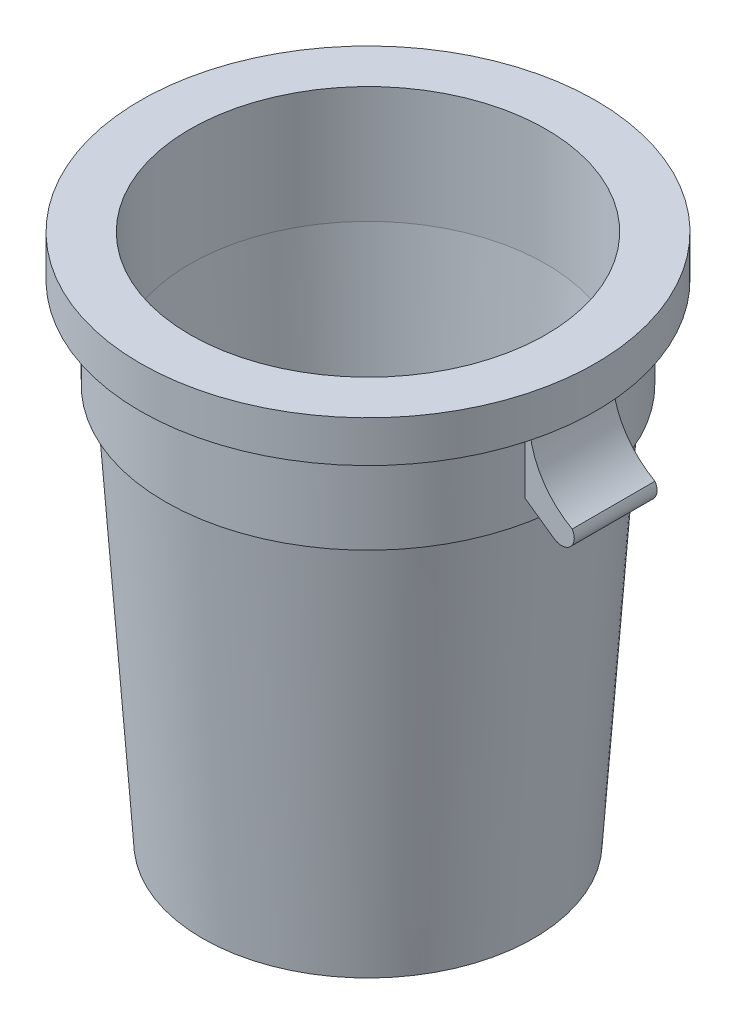
ISO-10303-21;
HEADER;
FILE_DESCRIPTION(('STEP AP214'),'2;1');
FILE_NAME('part.step','',(''),(''),'','','');
FILE_SCHEMA(('AUTOMOTIVE_DESIGN { 1 0 10303 214 1 1 1 1 }'));
ENDSEC;
DATA;
#1=APPLICATION_CONTEXT('core data for automotive mechanical design processes');
#2=APPLICATION_PROTOCOL_DEFINITION('international standard','automotive_design',2000,#1);
#3=PRODUCT_CONTEXT('',#1,'mechanical');
#4=PRODUCT('Part','Part','',(#3));
#5=PRODUCT_RELATED_PRODUCT_CATEGORY('part','',(#4));
#6=PRODUCT_DEFINITION_FORMATION('','',#4);
#7=PRODUCT_DEFINITION_CONTEXT('part definition',#1,'design');
#8=PRODUCT_DEFINITION('design','',#6,#7);
#9=PRODUCT_DEFINITION_SHAPE('','',#8);
#10=(LENGTH_UNIT() NAMED_UNIT(*) SI_UNIT(.MILLI.,.METRE.));
#11=(NAMED_UNIT(*) PLANE_ANGLE_UNIT() SI_UNIT($,.RADIAN.));
#12=(NAMED_UNIT(*) SI_UNIT($,.STERADIAN.) SOLID_ANGLE_UNIT());
#13=UNCERTAINTY_MEASURE_WITH_UNIT(LENGTH_MEASURE(1.E-05),#10,'distance_accuracy_value','');
#14=(GEOMETRIC_REPRESENTATION_CONTEXT(3) GLOBAL_UNCERTAINTY_ASSIGNED_CONTEXT((#13)) GLOBAL_UNIT_ASSIGNED_CONTEXT((#10,
#11,#12)) REPRESENTATION_CONTEXT('',''));
#15=CARTESIAN_POINT('',(0.,0.,0.));
#16=DIRECTION('',(0.,0.,1.));
#17=DIRECTION('',(1.,0.,0.));
#18=AXIS2_PLACEMENT_3D('',#15,#16,#17);
#19=CARTESIAN_POINT('',(0.,19.05,0.));
#20=DIRECTION('',(0.,1.,0.));
#21=DIRECTION('',(0.,0.,1.));
#22=AXIS2_PLACEMENT_3D('',#19,#20,#21);
#23=CYLINDRICAL_SURFACE('',#22,248.92);
#24=CARTESIAN_POINT('',(0.,486.918,0.));
#25=DIRECTION('',(0.,1.,0.));
#26=DIRECTION('',(0.,0.,1.));
#27=AXIS2_PLACEMENT_3D('',#24,#25,#26);
#28=CIRCLE('',#27,248.92);
#29=CARTESIAN_POINT('',(0.,486.918,248.92));
#30=VERTEX_POINT('',#29);
#31=EDGE_CURVE('E165',#30,#30,#28,.T.);
#32=ORIENTED_EDGE('',*,*,#31,.T.);
#33=EDGE_LOOP('',(#32));
#34=FACE_BOUND('',#33,.T.);
#35=DIRECTION('',(0.,1.,0.));
#36=VECTOR('',#35,1.);
#37=CARTESIAN_POINT('',(243.681198289897,19.05,-50.8));
#38=LINE('',#37,#36);
#39=CARTESIAN_POINT('',(243.681198289897,513.1922484486,-50.8));
#40=VERTEX_POINT('',#39);
#41=CARTESIAN_POINT('',(243.681198289897,598.424,-50.8));
#42=VERTEX_POINT('',#41);
#43=EDGE_CURVE('E137',#40,#42,#38,.T.);
#44=ORIENTED_EDGE('',*,*,#43,.F.);
#45=CARTESIAN_POINT('',(0.,683.81966041116,0.));
#46=DIRECTION('',(-0.573576436351044,-0.819152044288993,0.));
#47=DIRECTION('',(-0.819152044288994,0.573576436351044,0.));
#48=AXIS2_PLACEMENT_3D('',#45,#46,#47);
#49=ELLIPSE('',#48,303.875210634501,248.92);
#50=CARTESIAN_POINT('',(243.681198289897,513.1922484486,50.8));
#51=VERTEX_POINT('',#50);
#52=EDGE_CURVE('E11',#40,#51,#49,.T.);
#53=ORIENTED_EDGE('',*,*,#52,.T.);
#54=DIRECTION('',(0.,1.,0.));
#55=VECTOR('',#54,1.);
#56=CARTESIAN_POINT('',(243.681198289897,19.05,50.8));
#57=LINE('',#56,#55);
#58=CARTESIAN_POINT('',(243.681198289897,598.424,50.8));
#59=VERTEX_POINT('',#58);
#60=EDGE_CURVE('E102',#51,#59,#57,.T.);
#61=ORIENTED_EDGE('',*,*,#60,.T.);
#62=CARTESIAN_POINT('',(0.,598.424,0.));
#63=DIRECTION('',(0.,1.,0.));
#64=DIRECTION('',(0.,0.,1.));
#65=AXIS2_PLACEMENT_3D('',#62,#63,#64);
#66=CIRCLE('',#65,248.92);
#67=EDGE_CURVE('E161',#42,#59,#66,.T.);
#68=ORIENTED_EDGE('',*,*,#67,.F.);
#69=EDGE_LOOP('',(#44,#53,#61,#68));
#70=FACE_BOUND('',#69,.T.);
#71=ADVANCED_FACE('F37',(#34,#70),#23,.T.);
#72=CARTESIAN_POINT('',(0.,598.424,0.));
#73=DIRECTION('',(0.,1.,0.));
#74=DIRECTION('',(0.,0.,1.));
#75=AXIS2_PLACEMENT_3D('',#72,#73,#74);
#76=PLANE('',#75);
#77=DIRECTION('',(-1.,0.,0.));
#78=VECTOR('',#77,1.);
#79=CARTESIAN_POINT('',(236.22,598.424,-50.8));
#80=LINE('',#79,#78);
#81=CARTESIAN_POINT('',(248.868157866771,598.424,-50.8));
#82=VERTEX_POINT('',#81);
#83=EDGE_CURVE('E128',#82,#42,#80,.T.);
#84=ORIENTED_EDGE('',*,*,#83,.T.);
#85=ORIENTED_EDGE('',*,*,#67,.T.);
#86=DIRECTION('',(-1.,0.,0.));
#87=VECTOR('',#86,1.);
#88=CARTESIAN_POINT('',(236.22,598.424,50.8));
#89=LINE('',#88,#87);
#90=CARTESIAN_POINT('',(248.868157866771,598.424,50.8));
#91=VERTEX_POINT('',#90);
#92=EDGE_CURVE('E116',#91,#59,#89,.T.);
#93=ORIENTED_EDGE('',*,*,#92,.F.);
#94=CARTESIAN_POINT('',(0.,598.424,0.));
#95=DIRECTION('',(0.,1.,0.));
#96=DIRECTION('',(0.,0.,1.));
#97=AXIS2_PLACEMENT_3D('',#94,#95,#96);
#98=CIRCLE('',#97,254.);
#99=EDGE_CURVE('E157',#82,#91,#98,.T.);
#100=ORIENTED_EDGE('',*,*,#99,.F.);
#101=EDGE_LOOP('',(#84,#85,#93,#100));
#102=FACE_BOUND('',#101,.T.);
#103=ADVANCED_FACE('F183',(#102),#76,.F.);
#104=CARTESIAN_POINT('',(0.,19.05,0.));
#105=DIRECTION('',(0.,1.,0.));
#106=DIRECTION('',(0.,0.,1.));
#107=AXIS2_PLACEMENT_3D('',#104,#105,#106);
#108=CYLINDRICAL_SURFACE('',#107,218.418109165987);
#109=CARTESIAN_POINT('',(0.,649.224,0.));
#110=DIRECTION('',(0.,1.,0.));
#111=DIRECTION('',(0.,0.,1.));
#112=AXIS2_PLACEMENT_3D('',#109,#110,#111);
#113=CIRCLE('',#112,218.418109165987);
#114=CARTESIAN_POINT('',(0.,649.224,218.418109165987));
#115=VERTEX_POINT('',#114);
#116=EDGE_CURVE('E139',#115,#115,#113,.T.);
#117=ORIENTED_EDGE('',*,*,#116,.T.);
#118=EDGE_LOOP('',(#117));
#119=FACE_BOUND('',#118,.T.);
#120=CARTESIAN_POINT('',(0.,505.968,0.));
#121=DIRECTION('',(0.,1.,0.));
#122=DIRECTION('',(0.,0.,1.));
#123=AXIS2_PLACEMENT_3D('',#120,#121,#122);
#124=CIRCLE('',#123,218.418109165987);
#125=CARTESIAN_POINT('',(0.,505.968,218.418109165987));
#126=VERTEX_POINT('',#125);
#127=EDGE_CURVE('E45',#126,#126,#124,.T.);
#128=ORIENTED_EDGE('',*,*,#127,.F.);
#129=EDGE_LOOP('',(#128));
#130=FACE_BOUND('',#129,.T.);
#131=ADVANCED_FACE('F39',(#119,#130),#108,.F.);
#132=CARTESIAN_POINT('',(0.,19.05,0.));
#133=DIRECTION('',(0.,1.,0.));
#134=DIRECTION('',(0.,0.,1.));
#135=AXIS2_PLACEMENT_3D('',#132,#133,#134);
#136=CONICAL_SURFACE('',#135,185.398109165987,0.0677106247639701);
#137=ORIENTED_EDGE('',*,*,#127,.T.);
#138=EDGE_LOOP('',(#137));
#139=FACE_BOUND('',#138,.T.);
#140=CARTESIAN_POINT('',(0.,19.05,0.));
#141=DIRECTION('',(0.,1.,0.));
#142=DIRECTION('',(0.,0.,1.));
#143=AXIS2_PLACEMENT_3D('',#140,#141,#142);
#144=CIRCLE('',#143,185.398109165987);
#145=CARTESIAN_POINT('',(0.,19.05,185.398109165987));
#146=VERTEX_POINT('',#145);
#147=EDGE_CURVE('E174',#146,#146,#144,.T.);
#148=ORIENTED_EDGE('',*,*,#147,.F.);
#149=EDGE_LOOP('',(#148));
#150=FACE_BOUND('',#149,.T.);
#151=ADVANCED_FACE('F179',(#139,#150),#136,.F.);
#152=CARTESIAN_POINT('',(0.,19.05,0.));
#153=DIRECTION('',(0.,1.,0.));
#154=DIRECTION('',(0.,0.,1.));
#155=AXIS2_PLACEMENT_3D('',#152,#153,#154);
#156=PLANE('',#155);
#157=ORIENTED_EDGE('',*,*,#147,.T.);
#158=EDGE_LOOP('',(#157));
#159=FACE_BOUND('',#158,.T.);
#160=ADVANCED_FACE('F189',(#159),#156,.T.);
#161=CARTESIAN_POINT('',(0.,0.,0.));
#162=DIRECTION('',(0.,1.,0.));
#163=DIRECTION('',(0.,0.,1.));
#164=AXIS2_PLACEMENT_3D('',#161,#162,#163);
#165=PLANE('',#164);
#166=CARTESIAN_POINT('',(0.,0.,0.));
#167=DIRECTION('',(0.,1.,0.));
#168=DIRECTION('',(0.,0.,1.));
#169=AXIS2_PLACEMENT_3D('',#166,#167,#168);
#170=CIRCLE('',#169,203.2);
#171=CARTESIAN_POINT('',(0.,0.,203.2));
#172=VERTEX_POINT('',#171);
#173=EDGE_CURVE('E171',#172,#172,#170,.T.);
#174=ORIENTED_EDGE('',*,*,#173,.F.);
#175=EDGE_LOOP('',(#174));
#176=FACE_BOUND('',#175,.T.);
#177=ADVANCED_FACE('F208',(#176),#165,.F.);
#178=CARTESIAN_POINT('',(0.,0.,0.));
#179=DIRECTION('',(0.,1.,0.));
#180=DIRECTION('',(0.,0.,1.));
#181=AXIS2_PLACEMENT_3D('',#178,#179,#180);
#182=CONICAL_SURFACE('',#181,203.2,0.0677106247639701);
#183=CARTESIAN_POINT('',(0.,486.918,0.));
#184=DIRECTION('',(0.,1.,0.));
#185=DIRECTION('',(0.,0.,1.));
#186=AXIS2_PLACEMENT_3D('',#183,#184,#185);
#187=CIRCLE('',#186,236.22);
#188=CARTESIAN_POINT('',(0.,486.918,236.22));
#189=VERTEX_POINT('',#188);
#190=EDGE_CURVE('E168',#189,#189,#187,.T.);
#191=ORIENTED_EDGE('',*,*,#190,.F.);
#192=EDGE_LOOP('',(#191));
#193=FACE_BOUND('',#192,.T.);
#194=ORIENTED_EDGE('',*,*,#173,.T.);
#195=EDGE_LOOP('',(#194));
#196=FACE_BOUND('',#195,.T.);
#197=ADVANCED_FACE('F204',(#193,#196),#182,.T.);
#198=CARTESIAN_POINT('',(0.,486.918,0.));
#199=DIRECTION('',(0.,1.,0.));
#200=DIRECTION('',(0.,0.,1.));
#201=AXIS2_PLACEMENT_3D('',#198,#199,#200);
#202=PLANE('',#201);
#203=ORIENTED_EDGE('',*,*,#31,.F.);
#204=EDGE_LOOP('',(#203));
#205=FACE_BOUND('',#204,.T.);
#206=ORIENTED_EDGE('',*,*,#190,.T.);
#207=EDGE_LOOP('',(#206));
#208=FACE_BOUND('',#207,.T.);
#209=ADVANCED_FACE('F201',(#205,#208),#202,.F.);
#210=CARTESIAN_POINT('',(248.92,598.424,50.545361805017));
#211=VERTEX_POINT('',#210);
#212=CARTESIAN_POINT('',(248.92,598.424,-50.545361805017));
#213=VERTEX_POINT('',#212);
#214=EDGE_CURVE('E162',#211,#213,#98,.T.);
#215=ORIENTED_EDGE('',*,*,#214,.F.);
#216=DIRECTION('',(0.,0.,1.));
#217=VECTOR('',#216,1.);
#218=CARTESIAN_POINT('',(248.92,598.424,-50.8));
#219=LINE('',#218,#217);
#220=EDGE_CURVE('E133',#213,#211,#219,.T.);
#221=ORIENTED_EDGE('',*,*,#220,.F.);
#222=EDGE_LOOP('',(#215,#221));
#223=FACE_BOUND('',#222,.T.);
#224=ADVANCED_FACE('F192',(#223),#76,.F.);
#225=CARTESIAN_POINT('',(0.,19.05,0.));
#226=DIRECTION('',(0.,1.,0.));
#227=DIRECTION('',(0.,0.,1.));
#228=AXIS2_PLACEMENT_3D('',#225,#226,#227);
#229=CYLINDRICAL_SURFACE('',#228,254.);
#230=CARTESIAN_POINT('',(0.,617.474,0.));
#231=DIRECTION('',(0.,1.,0.));
#232=DIRECTION('',(0.,0.,1.));
#233=AXIS2_PLACEMENT_3D('',#230,#231,#232);
#234=CIRCLE('',#233,254.);
#235=CARTESIAN_POINT('',(0.,617.474,254.));
#236=VERTEX_POINT('',#235);
#237=EDGE_CURVE('E154',#236,#236,#234,.T.);
#238=ORIENTED_EDGE('',*,*,#237,.F.);
#239=EDGE_LOOP('',(#238));
#240=FACE_BOUND('',#239,.T.);
#241=EDGE_CURVE('E158',#91,#211,#98,.T.);
#242=ORIENTED_EDGE('',*,*,#241,.T.);
#243=ORIENTED_EDGE('',*,*,#214,.T.);
#244=EDGE_CURVE('E400',#213,#82,#98,.T.);
#245=ORIENTED_EDGE('',*,*,#244,.T.);
#246=ORIENTED_EDGE('',*,*,#99,.T.);
#247=EDGE_LOOP('',(#242,#243,#245,#246));
#248=FACE_BOUND('',#247,.T.);
#249=ADVANCED_FACE('F239',(#240,#248),#229,.T.);
#250=CARTESIAN_POINT('',(0.,617.474,0.));
#251=DIRECTION('',(0.,1.,0.));
#252=DIRECTION('',(0.,0.,1.));
#253=AXIS2_PLACEMENT_3D('',#250,#251,#252);
#254=PLANE('',#253);
#255=CARTESIAN_POINT('',(0.,617.474,0.));
#256=DIRECTION('',(0.,1.,0.));
#257=DIRECTION('',(0.,0.,1.));
#258=AXIS2_PLACEMENT_3D('',#255,#256,#257);
#259=CIRCLE('',#258,266.7);
#260=CARTESIAN_POINT('',(0.,617.474,266.7));
#261=VERTEX_POINT('',#260);
#262=EDGE_CURVE('E151',#261,#261,#259,.T.);
#263=ORIENTED_EDGE('',*,*,#262,.F.);
#264=EDGE_LOOP('',(#263));
#265=FACE_BOUND('',#264,.T.);
#266=ORIENTED_EDGE('',*,*,#237,.T.);
#267=EDGE_LOOP('',(#266));
#268=FACE_BOUND('',#267,.T.);
#269=ADVANCED_FACE('F247',(#265,#268),#254,.F.);
#270=CARTESIAN_POINT('',(0.,19.05,0.));
#271=DIRECTION('',(0.,1.,0.));
#272=DIRECTION('',(0.,0.,1.));
#273=AXIS2_PLACEMENT_3D('',#270,#271,#272);
#274=CYLINDRICAL_SURFACE('',#273,266.7);
#275=ORIENTED_EDGE('',*,*,#262,.T.);
#276=EDGE_LOOP('',(#275));
#277=FACE_BOUND('',#276,.T.);
#278=CARTESIAN_POINT('',(0.,598.424,0.));
#279=DIRECTION('',(0.,1.,0.));
#280=DIRECTION('',(0.,0.,1.));
#281=AXIS2_PLACEMENT_3D('',#278,#279,#280);
#282=CIRCLE('',#281,266.7);
#283=CARTESIAN_POINT('',(0.,598.424,266.7));
#284=VERTEX_POINT('',#283);
#285=EDGE_CURVE('E148',#284,#284,#282,.T.);
#286=ORIENTED_EDGE('',*,*,#285,.F.);
#287=EDGE_LOOP('',(#286));
#288=FACE_BOUND('',#287,.T.);
#289=ADVANCED_FACE('F254',(#277,#288),#274,.F.);
#290=CARTESIAN_POINT('',(0.,598.424,0.));
#291=DIRECTION('',(0.,1.,0.));
#292=DIRECTION('',(0.,0.,1.));
#293=AXIS2_PLACEMENT_3D('',#290,#291,#292);
#294=PLANE('',#293);
#295=CARTESIAN_POINT('',(0.,598.424,0.));
#296=DIRECTION('',(0.,1.,0.));
#297=DIRECTION('',(0.,0.,1.));
#298=AXIS2_PLACEMENT_3D('',#295,#296,#297);
#299=CIRCLE('',#298,279.4);
#300=CARTESIAN_POINT('',(0.,598.424,279.4));
#301=VERTEX_POINT('',#300);
#302=EDGE_CURVE('E145',#301,#301,#299,.T.);
#303=ORIENTED_EDGE('',*,*,#302,.F.);
#304=EDGE_LOOP('',(#303));
#305=FACE_BOUND('',#304,.T.);
#306=ORIENTED_EDGE('',*,*,#285,.T.);
#307=EDGE_LOOP('',(#306));
#308=FACE_BOUND('',#307,.T.);
#309=ADVANCED_FACE('F262',(#305,#308),#294,.F.);
#310=CARTESIAN_POINT('',(0.,19.05,0.));
#311=DIRECTION('',(0.,1.,0.));
#312=DIRECTION('',(0.,0.,1.));
#313=AXIS2_PLACEMENT_3D('',#310,#311,#312);
#314=CYLINDRICAL_SURFACE('',#313,279.4);
#315=CARTESIAN_POINT('',(0.,649.224,0.));
#316=DIRECTION('',(0.,1.,0.));
#317=DIRECTION('',(0.,0.,1.));
#318=AXIS2_PLACEMENT_3D('',#315,#316,#317);
#319=CIRCLE('',#318,279.4);
#320=CARTESIAN_POINT('',(0.,649.224,279.4));
#321=VERTEX_POINT('',#320);
#322=EDGE_CURVE('E142',#321,#321,#319,.T.);
#323=ORIENTED_EDGE('',*,*,#322,.F.);
#324=EDGE_LOOP('',(#323));
#325=FACE_BOUND('',#324,.T.);
#326=ORIENTED_EDGE('',*,*,#302,.T.);
#327=EDGE_LOOP('',(#326));
#328=FACE_BOUND('',#327,.T.);
#329=ADVANCED_FACE('F270',(#325,#328),#314,.T.);
#330=CARTESIAN_POINT('',(0.,649.224,0.));
#331=DIRECTION('',(0.,-1.,0.));
#332=DIRECTION('',(0.,0.,-1.));
#333=AXIS2_PLACEMENT_3D('',#330,#331,#332);
#334=PLANE('',#333);
#335=ORIENTED_EDGE('',*,*,#116,.F.);
#336=EDGE_LOOP('',(#335));
#337=FACE_BOUND('',#336,.T.);
#338=ORIENTED_EDGE('',*,*,#322,.T.);
#339=EDGE_LOOP('',(#338));
#340=FACE_BOUND('',#339,.T.);
#341=ADVANCED_FACE('F278',(#337,#340),#334,.F.);
#342=CARTESIAN_POINT('',(350.52,598.424,-50.8));
#343=DIRECTION('',(0.,0.,1.));
#344=DIRECTION('',(1.,0.,0.));
#345=AXIS2_PLACEMENT_3D('',#342,#343,#344);
#346=PLANE('',#345);
#347=DIRECTION('',(0.819152044288994,-0.573576436351042,0.));
#348=VECTOR('',#347,1.);
#349=CARTESIAN_POINT('',(248.92,509.524,-50.8));
#350=LINE('',#349,#348);
#351=CARTESIAN_POINT('',(279.4,488.181674235368,-50.8));
#352=VERTEX_POINT('',#351);
#353=EDGE_CURVE('E107',#40,#352,#350,.T.);
#354=ORIENTED_EDGE('',*,*,#353,.F.);
#355=ORIENTED_EDGE('',*,*,#43,.T.);
#356=ORIENTED_EDGE('',*,*,#83,.F.);
#357=CARTESIAN_POINT('',(248.92,598.424,-50.8));
#358=VERTEX_POINT('',#357);
#359=EDGE_CURVE('E52',#358,#82,#80,.T.);
#360=ORIENTED_EDGE('',*,*,#359,.F.);
#361=CARTESIAN_POINT('',(350.52,598.424,-50.8));
#362=DIRECTION('',(0.,0.,-1.));
#363=DIRECTION('',(1.,0.,0.));
#364=AXIS2_PLACEMENT_3D('',#361,#362,#363);
#365=CIRCLE('',#364,101.6);
#366=CARTESIAN_POINT('',(301.333111503166,509.524,-50.8));
#367=VERTEX_POINT('',#366);
#368=EDGE_CURVE('E125',#367,#358,#365,.T.);
#369=ORIENTED_EDGE('',*,*,#368,.F.);
#370=CARTESIAN_POINT('',(288.334369878016,500.941276768154,-50.8));
#371=DIRECTION('',(0.,0.,1.));
#372=DIRECTION('',(1.,0.,0.));
#373=AXIS2_PLACEMENT_3D('',#370,#371,#372);
#374=CIRCLE('',#373,15.5765985347209);
#375=EDGE_CURVE('E123',#352,#367,#374,.T.);
#376=ORIENTED_EDGE('',*,*,#375,.F.);
#377=EDGE_LOOP('',(#354,#355,#356,#360,#369,#376));
#378=FACE_BOUND('',#377,.T.);
#379=ADVANCED_FACE('F286',(#378),#346,.F.);
#380=CARTESIAN_POINT('',(350.52,598.424,50.8));
#381=DIRECTION('',(0.,0.,1.));
#382=DIRECTION('',(1.,0.,0.));
#383=AXIS2_PLACEMENT_3D('',#380,#381,#382);
#384=PLANE('',#383);
#385=ORIENTED_EDGE('',*,*,#60,.F.);
#386=DIRECTION('',(0.819152044288994,-0.573576436351042,0.));
#387=VECTOR('',#386,1.);
#388=CARTESIAN_POINT('',(248.92,509.524,50.8));
#389=LINE('',#388,#387);
#390=CARTESIAN_POINT('',(279.4,488.181674235368,50.8));
#391=VERTEX_POINT('',#390);
#392=EDGE_CURVE('E94',#51,#391,#389,.T.);
#393=ORIENTED_EDGE('',*,*,#392,.T.);
#394=CARTESIAN_POINT('',(288.334369878016,500.941276768154,50.8));
#395=DIRECTION('',(0.,0.,1.));
#396=DIRECTION('',(1.,0.,0.));
#397=AXIS2_PLACEMENT_3D('',#394,#395,#396);
#398=CIRCLE('',#397,15.5765985347209);
#399=CARTESIAN_POINT('',(301.333111503166,509.524,50.8));
#400=VERTEX_POINT('',#399);
#401=EDGE_CURVE('E99',#391,#400,#398,.T.);
#402=ORIENTED_EDGE('',*,*,#401,.T.);
#403=CARTESIAN_POINT('',(350.52,598.424,50.8));
#404=DIRECTION('',(0.,0.,-1.));
#405=DIRECTION('',(1.,0.,0.));
#406=AXIS2_PLACEMENT_3D('',#403,#404,#405);
#407=CIRCLE('',#406,101.6);
#408=CARTESIAN_POINT('',(248.92,598.424,50.8));
#409=VERTEX_POINT('',#408);
#410=EDGE_CURVE('E114',#400,#409,#407,.T.);
#411=ORIENTED_EDGE('',*,*,#410,.T.);
#412=EDGE_CURVE('E119',#409,#91,#89,.T.);
#413=ORIENTED_EDGE('',*,*,#412,.T.);
#414=ORIENTED_EDGE('',*,*,#92,.T.);
#415=EDGE_LOOP('',(#385,#393,#402,#411,#413,#414));
#416=FACE_BOUND('',#415,.T.);
#417=ADVANCED_FACE('F96',(#416),#384,.T.);
#418=CARTESIAN_POINT('',(236.22,598.424,-50.8));
#419=DIRECTION('',(0.,1.,0.));
#420=DIRECTION('',(0.,0.,1.));
#421=AXIS2_PLACEMENT_3D('',#418,#419,#420);
#422=PLANE('',#421);
#423=ORIENTED_EDGE('',*,*,#241,.F.);
#424=ORIENTED_EDGE('',*,*,#412,.F.);
#425=EDGE_CURVE('E134',#211,#409,#219,.T.);
#426=ORIENTED_EDGE('',*,*,#425,.F.);
#427=EDGE_LOOP('',(#423,#424,#426));
#428=FACE_BOUND('',#427,.T.);
#429=ADVANCED_FACE('F300',(#428),#422,.T.);
#430=ORIENTED_EDGE('',*,*,#244,.F.);
#431=EDGE_CURVE('E130',#358,#213,#219,.T.);
#432=ORIENTED_EDGE('',*,*,#431,.F.);
#433=ORIENTED_EDGE('',*,*,#359,.T.);
#434=EDGE_LOOP('',(#430,#432,#433));
#435=FACE_BOUND('',#434,.T.);
#436=ADVANCED_FACE('F307',(#435),#422,.T.);
#437=CARTESIAN_POINT('',(350.52,598.424,-50.8));
#438=DIRECTION('',(0.,0.,1.));
#439=DIRECTION('',(1.,0.,0.));
#440=AXIS2_PLACEMENT_3D('',#437,#438,#439);
#441=CYLINDRICAL_SURFACE('',#440,101.6);
#442=ORIENTED_EDGE('',*,*,#431,.T.);
#443=ORIENTED_EDGE('',*,*,#220,.T.);
#444=ORIENTED_EDGE('',*,*,#425,.T.);
#445=ORIENTED_EDGE('',*,*,#410,.F.);
#446=DIRECTION('',(0.,0.,1.));
#447=VECTOR('',#446,1.);
#448=CARTESIAN_POINT('',(301.333111503166,509.524,-50.8));
#449=LINE('',#448,#447);
#450=EDGE_CURVE('E111',#367,#400,#449,.T.);
#451=ORIENTED_EDGE('',*,*,#450,.F.);
#452=ORIENTED_EDGE('',*,*,#368,.T.);
#453=EDGE_LOOP('',(#442,#443,#444,#445,#451,#452));
#454=FACE_BOUND('',#453,.T.);
#455=ADVANCED_FACE('F315',(#454),#441,.F.);
#456=CARTESIAN_POINT('',(288.334369878016,500.941276768154,-50.8));
#457=DIRECTION('',(0.,0.,1.));
#458=DIRECTION('',(1.,0.,0.));
#459=AXIS2_PLACEMENT_3D('',#456,#457,#458);
#460=CYLINDRICAL_SURFACE('',#459,15.5765985347209);
#461=ORIENTED_EDGE('',*,*,#450,.T.);
#462=ORIENTED_EDGE('',*,*,#401,.F.);
#463=DIRECTION('',(0.,0.,1.));
#464=VECTOR('',#463,1.);
#465=CARTESIAN_POINT('',(279.4,488.181674235368,-50.8));
#466=LINE('',#465,#464);
#467=EDGE_CURVE('E105',#352,#391,#466,.T.);
#468=ORIENTED_EDGE('',*,*,#467,.F.);
#469=ORIENTED_EDGE('',*,*,#375,.T.);
#470=EDGE_LOOP('',(#461,#462,#468,#469));
#471=FACE_BOUND('',#470,.T.);
#472=ADVANCED_FACE('F113',(#471),#460,.T.);
#473=CARTESIAN_POINT('',(248.92,509.524,-50.8));
#474=DIRECTION('',(-0.573576436351044,-0.819152044288993,0.));
#475=DIRECTION('',(0.819152044288994,-0.573576436351044,0.));
#476=AXIS2_PLACEMENT_3D('',#473,#474,#475);
#477=PLANE('',#476);
#478=ORIENTED_EDGE('',*,*,#52,.F.);
#479=ORIENTED_EDGE('',*,*,#353,.T.);
#480=ORIENTED_EDGE('',*,*,#467,.T.);
#481=ORIENTED_EDGE('',*,*,#392,.F.);
#482=EDGE_LOOP('',(#478,#479,#480,#481));
#483=FACE_BOUND('',#482,.T.);
#484=ADVANCED_FACE('F106',(#483),#477,.T.);
#485=CLOSED_SHELL('',(#71,#103,#131,#151,#160,#177,#197,#209,#224,#249,#269,#289,#309,#329,#341,
#379,#417,#429,#436,#455,#472,#484));
#486=MANIFOLD_SOLID_BREP('B2',#485);
#487=ADVANCED_BREP_SHAPE_REPRESENTATION('',(#18,#486),#14);
#488=SHAPE_DEFINITION_REPRESENTATION(#9,#487);
ENDSEC;
END-ISO-10303-21;
